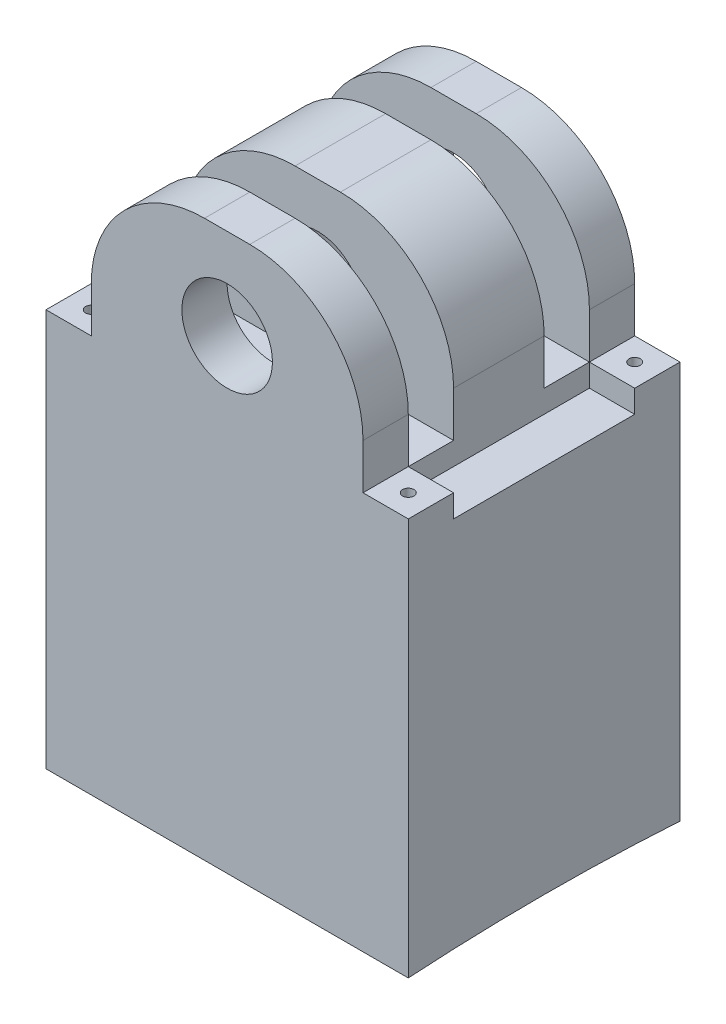
ISO-10303-21;
HEADER;
FILE_DESCRIPTION(('STEP AP214'),'2;1');
FILE_NAME('part.step','',(''),(''),'','','');
FILE_SCHEMA(('AUTOMOTIVE_DESIGN { 1 0 10303 214 1 1 1 1 }'));
ENDSEC;
DATA;
#1=APPLICATION_CONTEXT('core data for automotive mechanical design processes');
#2=APPLICATION_PROTOCOL_DEFINITION('international standard','automotive_design',2000,#1);
#3=PRODUCT_CONTEXT('',#1,'mechanical');
#4=PRODUCT('Part','Part','',(#3));
#5=PRODUCT_RELATED_PRODUCT_CATEGORY('part','',(#4));
#6=PRODUCT_DEFINITION_FORMATION('','',#4);
#7=PRODUCT_DEFINITION_CONTEXT('part definition',#1,'design');
#8=PRODUCT_DEFINITION('design','',#6,#7);
#9=PRODUCT_DEFINITION_SHAPE('','',#8);
#10=(LENGTH_UNIT() NAMED_UNIT(*) SI_UNIT(.MILLI.,.METRE.));
#11=(NAMED_UNIT(*) PLANE_ANGLE_UNIT() SI_UNIT($,.RADIAN.));
#12=(NAMED_UNIT(*) SI_UNIT($,.STERADIAN.) SOLID_ANGLE_UNIT());
#13=UNCERTAINTY_MEASURE_WITH_UNIT(LENGTH_MEASURE(1.E-05),#10,'distance_accuracy_value','');
#14=(GEOMETRIC_REPRESENTATION_CONTEXT(3) GLOBAL_UNCERTAINTY_ASSIGNED_CONTEXT((#13)) GLOBAL_UNIT_ASSIGNED_CONTEXT((#10,
#11,#12)) REPRESENTATION_CONTEXT('',''));
#15=CARTESIAN_POINT('',(0.,0.,0.));
#16=DIRECTION('',(0.,0.,1.));
#17=DIRECTION('',(1.,0.,0.));
#18=AXIS2_PLACEMENT_3D('',#15,#16,#17);
#19=CARTESIAN_POINT('',(-101.6,-50.8,152.4));
#20=DIRECTION('',(1.,0.,0.));
#21=DIRECTION('',(0.,0.,-1.));
#22=AXIS2_PLACEMENT_3D('',#19,#20,#21);
#23=PLANE('',#22);
#24=CARTESIAN_POINT('',(-101.6,-1458.68769541547,76.2));
#25=DIRECTION('',(-1.,0.,0.));
#26=DIRECTION('',(0.,0.,1.));
#27=AXIS2_PLACEMENT_3D('',#24,#25,#26);
#28=CIRCLE('',#27,1200.);
#29=CARTESIAN_POINT('',(-101.6,-261.109489200941,152.4));
#30=VERTEX_POINT('',#29);
#31=CARTESIAN_POINT('',(-101.6,-261.109489200941,0.));
#32=VERTEX_POINT('',#31);
#33=EDGE_CURVE('E222',#30,#32,#28,.T.);
#34=ORIENTED_EDGE('',*,*,#33,.F.);
#35=DIRECTION('',(0.,-1.,0.));
#36=VECTOR('',#35,1.);
#37=CARTESIAN_POINT('',(-101.6,-50.8,152.4));
#38=LINE('',#37,#36);
#39=CARTESIAN_POINT('',(-101.6,-38.1,152.4));
#40=VERTEX_POINT('',#39);
#41=EDGE_CURVE('E426',#40,#30,#38,.T.);
#42=ORIENTED_EDGE('',*,*,#41,.F.);
#43=DIRECTION('',(0.,0.,-1.));
#44=VECTOR('',#43,1.);
#45=CARTESIAN_POINT('',(-101.6,-38.1,152.4));
#46=LINE('',#45,#44);
#47=CARTESIAN_POINT('',(-101.6,-38.1,127.));
#48=VERTEX_POINT('',#47);
#49=EDGE_CURVE('E465',#40,#48,#46,.T.);
#50=ORIENTED_EDGE('',*,*,#49,.T.);
#51=DIRECTION('',(0.,1.,0.));
#52=VECTOR('',#51,1.);
#53=CARTESIAN_POINT('',(-101.6,-50.8000000000002,127.));
#54=LINE('',#53,#52);
#55=CARTESIAN_POINT('',(-101.6,-50.8000000000002,127.));
#56=VERTEX_POINT('',#55);
#57=EDGE_CURVE('E60',#56,#48,#54,.T.);
#58=ORIENTED_EDGE('',*,*,#57,.F.);
#59=DIRECTION('',(0.,0.,-1.));
#60=VECTOR('',#59,1.);
#61=CARTESIAN_POINT('',(-101.6,-50.8,444.838576880617));
#62=LINE('',#61,#60);
#63=CARTESIAN_POINT('',(-101.6,-50.8000000000002,25.4));
#64=VERTEX_POINT('',#63);
#65=EDGE_CURVE('E253',#56,#64,#62,.T.);
#66=ORIENTED_EDGE('',*,*,#65,.T.);
#67=DIRECTION('',(0.,1.,0.));
#68=VECTOR('',#67,1.);
#69=CARTESIAN_POINT('',(-101.6,-50.8000000000002,25.4));
#70=LINE('',#69,#68);
#71=CARTESIAN_POINT('',(-101.6,-38.1,25.4));
#72=VERTEX_POINT('',#71);
#73=EDGE_CURVE('E279',#64,#72,#70,.T.);
#74=ORIENTED_EDGE('',*,*,#73,.T.);
#75=CARTESIAN_POINT('',(-101.6,-38.1,0.));
#76=VERTEX_POINT('',#75);
#77=EDGE_CURVE('E239',#72,#76,#46,.T.);
#78=ORIENTED_EDGE('',*,*,#77,.T.);
#79=DIRECTION('',(0.,-1.,0.));
#80=VECTOR('',#79,1.);
#81=CARTESIAN_POINT('',(-101.6,-50.8,0.));
#82=LINE('',#81,#80);
#83=EDGE_CURVE('E236',#76,#32,#82,.T.);
#84=ORIENTED_EDGE('',*,*,#83,.T.);
#85=EDGE_LOOP('',(#34,#42,#50,#58,#66,#74,#78,#84));
#86=FACE_BOUND('',#85,.T.);
#87=ADVANCED_FACE('F37',(#86),#23,.F.);
#88=CARTESIAN_POINT('',(101.6,-50.8,152.4));
#89=DIRECTION('',(-1.,0.,0.));
#90=DIRECTION('',(0.,0.,1.));
#91=AXIS2_PLACEMENT_3D('',#88,#89,#90);
#92=PLANE('',#91);
#93=CARTESIAN_POINT('',(101.6,-1458.68769541547,76.2));
#94=DIRECTION('',(-1.,0.,0.));
#95=DIRECTION('',(0.,0.,1.));
#96=AXIS2_PLACEMENT_3D('',#93,#94,#95);
#97=CIRCLE('',#96,1200.);
#98=CARTESIAN_POINT('',(101.6,-261.109489200941,152.4));
#99=VERTEX_POINT('',#98);
#100=CARTESIAN_POINT('',(101.6,-261.109489200941,0.));
#101=VERTEX_POINT('',#100);
#102=EDGE_CURVE('E233',#99,#101,#97,.T.);
#103=ORIENTED_EDGE('',*,*,#102,.T.);
#104=DIRECTION('',(0.,1.,0.));
#105=VECTOR('',#104,1.);
#106=CARTESIAN_POINT('',(101.6,-50.8,0.));
#107=LINE('',#106,#105);
#108=CARTESIAN_POINT('',(101.6,-38.1,0.));
#109=VERTEX_POINT('',#108);
#110=EDGE_CURVE('E243',#101,#109,#107,.T.);
#111=ORIENTED_EDGE('',*,*,#110,.T.);
#112=DIRECTION('',(0.,0.,-1.));
#113=VECTOR('',#112,1.);
#114=CARTESIAN_POINT('',(101.6,-38.1,152.4));
#115=LINE('',#114,#113);
#116=CARTESIAN_POINT('',(101.6,-38.1,25.4000000000001));
#117=VERTEX_POINT('',#116);
#118=EDGE_CURVE('E461',#117,#109,#115,.T.);
#119=ORIENTED_EDGE('',*,*,#118,.F.);
#120=DIRECTION('',(0.,1.,0.));
#121=VECTOR('',#120,1.);
#122=CARTESIAN_POINT('',(101.6,-50.8000000000001,25.4));
#123=LINE('',#122,#121);
#124=CARTESIAN_POINT('',(101.6,-50.8000000000001,25.4));
#125=VERTEX_POINT('',#124);
#126=EDGE_CURVE('E52',#125,#117,#123,.T.);
#127=ORIENTED_EDGE('',*,*,#126,.F.);
#128=DIRECTION('',(0.,0.,-1.));
#129=VECTOR('',#128,1.);
#130=CARTESIAN_POINT('',(101.6,-50.8,444.838576880617));
#131=LINE('',#130,#129);
#132=CARTESIAN_POINT('',(101.6,-50.8000000000001,127.));
#133=VERTEX_POINT('',#132);
#134=EDGE_CURVE('E257',#133,#125,#131,.T.);
#135=ORIENTED_EDGE('',*,*,#134,.F.);
#136=DIRECTION('',(0.,1.,0.));
#137=VECTOR('',#136,1.);
#138=CARTESIAN_POINT('',(101.6,-50.8000000000001,127.));
#139=LINE('',#138,#137);
#140=CARTESIAN_POINT('',(101.6,-38.0999999999999,127.));
#141=VERTEX_POINT('',#140);
#142=EDGE_CURVE('E260',#133,#141,#139,.T.);
#143=ORIENTED_EDGE('',*,*,#142,.T.);
#144=CARTESIAN_POINT('',(101.6,-38.1,152.4));
#145=VERTEX_POINT('',#144);
#146=EDGE_CURVE('E462',#145,#141,#115,.T.);
#147=ORIENTED_EDGE('',*,*,#146,.F.);
#148=DIRECTION('',(0.,1.,0.));
#149=VECTOR('',#148,1.);
#150=CARTESIAN_POINT('',(101.6,-50.8,152.4));
#151=LINE('',#150,#149);
#152=EDGE_CURVE('E428',#99,#145,#151,.T.);
#153=ORIENTED_EDGE('',*,*,#152,.F.);
#154=EDGE_LOOP('',(#103,#111,#119,#127,#135,#143,#147,#153));
#155=FACE_BOUND('',#154,.T.);
#156=ADVANCED_FACE('F562',(#155),#92,.F.);
#157=CARTESIAN_POINT('',(76.2,-38.1,152.4));
#158=DIRECTION('',(0.,-1.,0.));
#159=DIRECTION('',(1.,0.,0.));
#160=AXIS2_PLACEMENT_3D('',#157,#158,#159);
#161=PLANE('',#160);
#162=CARTESIAN_POINT('',(-88.9,-38.1,12.7));
#163=DIRECTION('',(0.,1.,0.));
#164=DIRECTION('',(0.,0.,1.));
#165=AXIS2_PLACEMENT_3D('',#162,#163,#164);
#166=CIRCLE('',#165,3.175);
#167=CARTESIAN_POINT('',(-88.9,-38.1,15.875));
#168=VERTEX_POINT('',#167);
#169=EDGE_CURVE('E281',#168,#168,#166,.T.);
#170=ORIENTED_EDGE('',*,*,#169,.F.);
#171=EDGE_LOOP('',(#170));
#172=FACE_BOUND('',#171,.T.);
#173=ORIENTED_EDGE('',*,*,#77,.F.);
#174=DIRECTION('',(-1.,0.,0.));
#175=VECTOR('',#174,1.);
#176=CARTESIAN_POINT('',(-101.6,-38.1,25.4));
#177=LINE('',#176,#175);
#178=CARTESIAN_POINT('',(-76.2,-38.1,25.4));
#179=VERTEX_POINT('',#178);
#180=EDGE_CURVE('E267',#179,#72,#177,.T.);
#181=ORIENTED_EDGE('',*,*,#180,.F.);
#182=DIRECTION('',(0.,0.,-1.));
#183=VECTOR('',#182,1.);
#184=CARTESIAN_POINT('',(-76.2,-38.1,152.4));
#185=LINE('',#184,#183);
#186=CARTESIAN_POINT('',(-76.2,-38.1,0.));
#187=VERTEX_POINT('',#186);
#188=EDGE_CURVE('E468',#179,#187,#185,.T.);
#189=ORIENTED_EDGE('',*,*,#188,.T.);
#190=DIRECTION('',(-1.,0.,0.));
#191=VECTOR('',#190,1.);
#192=CARTESIAN_POINT('',(-76.2,-38.1,0.));
#193=LINE('',#192,#191);
#194=EDGE_CURVE('E244',#187,#76,#193,.T.);
#195=ORIENTED_EDGE('',*,*,#194,.T.);
#196=EDGE_LOOP('',(#173,#181,#189,#195));
#197=FACE_BOUND('',#196,.T.);
#198=ADVANCED_FACE('F547',(#172,#197),#161,.F.);
#199=DIRECTION('',(1.,0.,0.));
#200=VECTOR('',#199,1.);
#201=CARTESIAN_POINT('',(-101.6,-38.1,25.4));
#202=LINE('',#201,#200);
#203=CARTESIAN_POINT('',(76.2,-38.0999999999999,25.4));
#204=VERTEX_POINT('',#203);
#205=EDGE_CURVE('E349',#179,#204,#202,.T.);
#206=ORIENTED_EDGE('',*,*,#205,.F.);
#207=DIRECTION('',(0.,0.,1.));
#208=VECTOR('',#207,1.);
#209=CARTESIAN_POINT('',(-76.2,-38.0999999999999,152.4));
#210=LINE('',#209,#208);
#211=CARTESIAN_POINT('',(-76.2,-38.1,50.8));
#212=VERTEX_POINT('',#211);
#213=EDGE_CURVE('E11',#179,#212,#210,.T.);
#214=ORIENTED_EDGE('',*,*,#213,.T.);
#215=DIRECTION('',(1.,0.,0.));
#216=VECTOR('',#215,1.);
#217=CARTESIAN_POINT('',(-101.6,-38.1,50.8));
#218=LINE('',#217,#216);
#219=CARTESIAN_POINT('',(76.2,-38.0999999999999,50.8));
#220=VERTEX_POINT('',#219);
#221=EDGE_CURVE('E346',#212,#220,#218,.T.);
#222=ORIENTED_EDGE('',*,*,#221,.T.);
#223=DIRECTION('',(0.,0.,1.));
#224=VECTOR('',#223,1.);
#225=CARTESIAN_POINT('',(76.2,-38.0999999999999,25.4));
#226=LINE('',#225,#224);
#227=EDGE_CURVE('E299',#204,#220,#226,.T.);
#228=ORIENTED_EDGE('',*,*,#227,.F.);
#229=EDGE_LOOP('',(#206,#214,#222,#228));
#230=FACE_BOUND('',#229,.T.);
#231=ADVANCED_FACE('F555',(#230),#161,.F.);
#232=DIRECTION('',(1.,0.,0.));
#233=VECTOR('',#232,1.);
#234=CARTESIAN_POINT('',(-101.6,-38.1,101.6));
#235=LINE('',#234,#233);
#236=CARTESIAN_POINT('',(-76.2,-38.1,101.6));
#237=VERTEX_POINT('',#236);
#238=CARTESIAN_POINT('',(76.2,-38.0999999999999,101.6));
#239=VERTEX_POINT('',#238);
#240=EDGE_CURVE('E340',#237,#239,#235,.T.);
#241=ORIENTED_EDGE('',*,*,#240,.F.);
#242=DIRECTION('',(0.,0.,-1.));
#243=VECTOR('',#242,1.);
#244=CARTESIAN_POINT('',(-76.2,-38.1,25.4));
#245=LINE('',#244,#243);
#246=CARTESIAN_POINT('',(-76.2,-38.1,127.));
#247=VERTEX_POINT('',#246);
#248=EDGE_CURVE('E275',#247,#237,#245,.T.);
#249=ORIENTED_EDGE('',*,*,#248,.F.);
#250=DIRECTION('',(1.,0.,0.));
#251=VECTOR('',#250,1.);
#252=CARTESIAN_POINT('',(-101.6,-38.1,127.));
#253=LINE('',#252,#251);
#254=CARTESIAN_POINT('',(76.2,-38.0999999999999,127.));
#255=VERTEX_POINT('',#254);
#256=EDGE_CURVE('E343',#247,#255,#253,.T.);
#257=ORIENTED_EDGE('',*,*,#256,.T.);
#258=DIRECTION('',(0.,0.,-1.));
#259=VECTOR('',#258,1.);
#260=CARTESIAN_POINT('',(76.2,-38.1,152.4));
#261=LINE('',#260,#259);
#262=EDGE_CURVE('E45',#255,#239,#261,.T.);
#263=ORIENTED_EDGE('',*,*,#262,.T.);
#264=EDGE_LOOP('',(#241,#249,#257,#263));
#265=FACE_BOUND('',#264,.T.);
#266=ADVANCED_FACE('F496',(#265),#161,.F.);
#267=CARTESIAN_POINT('',(88.8999999999999,-38.0999999999999,139.7));
#268=DIRECTION('',(0.,1.,0.));
#269=DIRECTION('',(0.,0.,1.));
#270=AXIS2_PLACEMENT_3D('',#267,#268,#269);
#271=CIRCLE('',#270,3.175);
#272=CARTESIAN_POINT('',(88.8999999999999,-38.0999999999999,142.875));
#273=VERTEX_POINT('',#272);
#274=EDGE_CURVE('E327',#273,#273,#271,.T.);
#275=ORIENTED_EDGE('',*,*,#274,.F.);
#276=EDGE_LOOP('',(#275));
#277=FACE_BOUND('',#276,.T.);
#278=ORIENTED_EDGE('',*,*,#146,.T.);
#279=DIRECTION('',(1.,0.,0.));
#280=VECTOR('',#279,1.);
#281=CARTESIAN_POINT('',(101.6,-38.0999999999999,127.));
#282=LINE('',#281,#280);
#283=EDGE_CURVE('E297',#255,#141,#282,.T.);
#284=ORIENTED_EDGE('',*,*,#283,.F.);
#285=DIRECTION('',(0.,0.,-1.));
#286=VECTOR('',#285,1.);
#287=CARTESIAN_POINT('',(76.2,-38.1,152.4));
#288=LINE('',#287,#286);
#289=CARTESIAN_POINT('',(76.2,-38.1,152.4));
#290=VERTEX_POINT('',#289);
#291=EDGE_CURVE('E458',#290,#255,#288,.T.);
#292=ORIENTED_EDGE('',*,*,#291,.F.);
#293=DIRECTION('',(-1.,0.,0.));
#294=VECTOR('',#293,1.);
#295=CARTESIAN_POINT('',(76.2,-38.1,152.4));
#296=LINE('',#295,#294);
#297=EDGE_CURVE('E430',#145,#290,#296,.T.);
#298=ORIENTED_EDGE('',*,*,#297,.F.);
#299=EDGE_LOOP('',(#278,#284,#292,#298));
#300=FACE_BOUND('',#299,.T.);
#301=ADVANCED_FACE('F603',(#277,#300),#161,.F.);
#302=CARTESIAN_POINT('',(-76.2,-38.1,152.4));
#303=VERTEX_POINT('',#302);
#304=EDGE_CURVE('E469',#303,#247,#185,.T.);
#305=ORIENTED_EDGE('',*,*,#304,.T.);
#306=DIRECTION('',(1.,0.,0.));
#307=VECTOR('',#306,1.);
#308=CARTESIAN_POINT('',(-101.6,-38.1,127.));
#309=LINE('',#308,#307);
#310=EDGE_CURVE('E273',#48,#247,#309,.T.);
#311=ORIENTED_EDGE('',*,*,#310,.F.);
#312=ORIENTED_EDGE('',*,*,#49,.F.);
#313=DIRECTION('',(-1.,0.,0.));
#314=VECTOR('',#313,1.);
#315=CARTESIAN_POINT('',(-76.2,-38.1,152.4));
#316=LINE('',#315,#314);
#317=EDGE_CURVE('E424',#303,#40,#316,.T.);
#318=ORIENTED_EDGE('',*,*,#317,.F.);
#319=EDGE_LOOP('',(#305,#311,#312,#318));
#320=FACE_BOUND('',#319,.T.);
#321=CARTESIAN_POINT('',(-88.9,-38.1,139.7));
#322=DIRECTION('',(0.,1.,0.));
#323=DIRECTION('',(0.,0.,1.));
#324=AXIS2_PLACEMENT_3D('',#321,#322,#323);
#325=CIRCLE('',#324,3.175);
#326=CARTESIAN_POINT('',(-88.9,-38.1,142.875));
#327=VERTEX_POINT('',#326);
#328=EDGE_CURVE('E315',#327,#327,#325,.T.);
#329=ORIENTED_EDGE('',*,*,#328,.F.);
#330=EDGE_LOOP('',(#329));
#331=FACE_BOUND('',#330,.T.);
#332=ADVANCED_FACE('F574',(#320,#331),#161,.F.);
#333=CARTESIAN_POINT('',(12.7,-12.7,152.4));
#334=DIRECTION('',(0.,0.,-1.));
#335=DIRECTION('',(-1.,0.,0.));
#336=AXIS2_PLACEMENT_3D('',#333,#334,#335);
#337=CYLINDRICAL_SURFACE('',#336,63.5);
#338=DIRECTION('',(0.,0.,-1.));
#339=VECTOR('',#338,1.);
#340=CARTESIAN_POINT('',(76.2,-12.7000000000005,152.4));
#341=LINE('',#340,#339);
#342=CARTESIAN_POINT('',(76.2,-12.7000000000005,152.4));
#343=VERTEX_POINT('',#342);
#344=CARTESIAN_POINT('',(76.2,-12.7000000000005,127.));
#345=VERTEX_POINT('',#344);
#346=EDGE_CURVE('E453',#343,#345,#341,.T.);
#347=ORIENTED_EDGE('',*,*,#346,.T.);
#348=CARTESIAN_POINT('',(12.7,-12.7,127.));
#349=DIRECTION('',(0.,0.,1.));
#350=DIRECTION('',(1.,0.,0.));
#351=AXIS2_PLACEMENT_3D('',#348,#349,#350);
#352=CIRCLE('',#351,63.5);
#353=CARTESIAN_POINT('',(12.6999999999996,50.8,127.));
#354=VERTEX_POINT('',#353);
#355=EDGE_CURVE('E398',#345,#354,#352,.T.);
#356=ORIENTED_EDGE('',*,*,#355,.T.);
#357=DIRECTION('',(0.,0.,-1.));
#358=VECTOR('',#357,1.);
#359=CARTESIAN_POINT('',(12.6999999999996,50.8,152.4));
#360=LINE('',#359,#358);
#361=CARTESIAN_POINT('',(12.6999999999996,50.8,152.4));
#362=VERTEX_POINT('',#361);
#363=EDGE_CURVE('E483',#362,#354,#360,.T.);
#364=ORIENTED_EDGE('',*,*,#363,.F.);
#365=CARTESIAN_POINT('',(12.7,-12.7,152.4));
#366=DIRECTION('',(0.,0.,1.));
#367=DIRECTION('',(1.,0.,0.));
#368=AXIS2_PLACEMENT_3D('',#365,#366,#367);
#369=CIRCLE('',#368,63.5);
#370=EDGE_CURVE('E414',#343,#362,#369,.T.);
#371=ORIENTED_EDGE('',*,*,#370,.F.);
#372=EDGE_LOOP('',(#347,#356,#364,#371));
#373=FACE_BOUND('',#372,.T.);
#374=ADVANCED_FACE('F595',(#373),#337,.T.);
#375=CARTESIAN_POINT('',(12.6999999999996,50.8,101.6));
#376=VERTEX_POINT('',#375);
#377=CARTESIAN_POINT('',(12.6999999999996,50.8,50.8));
#378=VERTEX_POINT('',#377);
#379=EDGE_CURVE('E486',#376,#378,#360,.T.);
#380=ORIENTED_EDGE('',*,*,#379,.F.);
#381=CARTESIAN_POINT('',(12.7,-12.7,101.6));
#382=DIRECTION('',(0.,0.,-1.));
#383=DIRECTION('',(-1.,0.,0.));
#384=AXIS2_PLACEMENT_3D('',#381,#382,#383);
#385=CIRCLE('',#384,63.5);
#386=CARTESIAN_POINT('',(76.2,-12.7000000000005,101.6));
#387=VERTEX_POINT('',#386);
#388=EDGE_CURVE('E385',#376,#387,#385,.T.);
#389=ORIENTED_EDGE('',*,*,#388,.T.);
#390=CARTESIAN_POINT('',(76.2,-12.7000000000005,50.8));
#391=VERTEX_POINT('',#390);
#392=EDGE_CURVE('E457',#387,#391,#341,.T.);
#393=ORIENTED_EDGE('',*,*,#392,.T.);
#394=CARTESIAN_POINT('',(12.7,-12.7,50.8));
#395=DIRECTION('',(0.,0.,1.));
#396=DIRECTION('',(1.,0.,0.));
#397=AXIS2_PLACEMENT_3D('',#394,#395,#396);
#398=CIRCLE('',#397,63.5);
#399=EDGE_CURVE('E372',#391,#378,#398,.T.);
#400=ORIENTED_EDGE('',*,*,#399,.T.);
#401=EDGE_LOOP('',(#380,#389,#393,#400));
#402=FACE_BOUND('',#401,.T.);
#403=ADVANCED_FACE('F529',(#402),#337,.T.);
#404=CARTESIAN_POINT('',(-12.6999999999995,50.8,152.4));
#405=DIRECTION('',(0.,-1.,0.));
#406=DIRECTION('',(0.,0.,-1.));
#407=AXIS2_PLACEMENT_3D('',#404,#405,#406);
#408=PLANE('',#407);
#409=ORIENTED_EDGE('',*,*,#363,.T.);
#410=DIRECTION('',(1.,0.,0.));
#411=VECTOR('',#410,1.);
#412=CARTESIAN_POINT('',(-101.6,50.8,127.));
#413=LINE('',#412,#411);
#414=CARTESIAN_POINT('',(-12.7,50.8,127.));
#415=VERTEX_POINT('',#414);
#416=EDGE_CURVE('E334',#415,#354,#413,.T.);
#417=ORIENTED_EDGE('',*,*,#416,.F.);
#418=DIRECTION('',(0.,0.,-1.));
#419=VECTOR('',#418,1.);
#420=CARTESIAN_POINT('',(-12.6999999999995,50.8,152.4));
#421=LINE('',#420,#419);
#422=CARTESIAN_POINT('',(-12.6999999999995,50.8,152.4));
#423=VERTEX_POINT('',#422);
#424=EDGE_CURVE('E478',#423,#415,#421,.T.);
#425=ORIENTED_EDGE('',*,*,#424,.F.);
#426=DIRECTION('',(-1.,0.,0.));
#427=VECTOR('',#426,1.);
#428=CARTESIAN_POINT('',(-12.6999999999995,50.8,152.4));
#429=LINE('',#428,#427);
#430=EDGE_CURVE('E417',#362,#423,#429,.T.);
#431=ORIENTED_EDGE('',*,*,#430,.F.);
#432=EDGE_LOOP('',(#409,#417,#425,#431));
#433=FACE_BOUND('',#432,.T.);
#434=ADVANCED_FACE('F591',(#433),#408,.F.);
#435=CARTESIAN_POINT('',(-12.7,50.8,101.6));
#436=VERTEX_POINT('',#435);
#437=CARTESIAN_POINT('',(-12.7,50.8,50.8));
#438=VERTEX_POINT('',#437);
#439=EDGE_CURVE('E482',#436,#438,#421,.T.);
#440=ORIENTED_EDGE('',*,*,#439,.F.);
#441=DIRECTION('',(1.,0.,0.));
#442=VECTOR('',#441,1.);
#443=CARTESIAN_POINT('',(-101.6,50.8,101.6));
#444=LINE('',#443,#442);
#445=EDGE_CURVE('E337',#436,#376,#444,.T.);
#446=ORIENTED_EDGE('',*,*,#445,.T.);
#447=ORIENTED_EDGE('',*,*,#379,.T.);
#448=DIRECTION('',(1.,0.,0.));
#449=VECTOR('',#448,1.);
#450=CARTESIAN_POINT('',(-101.6,50.8,50.8));
#451=LINE('',#450,#449);
#452=EDGE_CURVE('E333',#438,#378,#451,.T.);
#453=ORIENTED_EDGE('',*,*,#452,.F.);
#454=EDGE_LOOP('',(#440,#446,#447,#453));
#455=FACE_BOUND('',#454,.T.);
#456=ADVANCED_FACE('F527',(#455),#408,.F.);
#457=CARTESIAN_POINT('',(-12.7,-12.7,152.4));
#458=DIRECTION('',(0.,0.,-1.));
#459=DIRECTION('',(-1.,0.,0.));
#460=AXIS2_PLACEMENT_3D('',#457,#458,#459);
#461=CYLINDRICAL_SURFACE('',#460,63.5);
#462=ORIENTED_EDGE('',*,*,#424,.T.);
#463=CARTESIAN_POINT('',(-12.7,-12.7,127.));
#464=DIRECTION('',(0.,0.,1.));
#465=DIRECTION('',(1.,0.,0.));
#466=AXIS2_PLACEMENT_3D('',#463,#464,#465);
#467=CIRCLE('',#466,63.5);
#468=CARTESIAN_POINT('',(-76.2,-12.7000000000005,127.));
#469=VERTEX_POINT('',#468);
#470=EDGE_CURVE('E404',#415,#469,#467,.T.);
#471=ORIENTED_EDGE('',*,*,#470,.T.);
#472=DIRECTION('',(0.,0.,-1.));
#473=VECTOR('',#472,1.);
#474=CARTESIAN_POINT('',(-76.2,-12.7000000000005,152.4));
#475=LINE('',#474,#473);
#476=CARTESIAN_POINT('',(-76.2,-12.7000000000005,152.4));
#477=VERTEX_POINT('',#476);
#478=EDGE_CURVE('E473',#477,#469,#475,.T.);
#479=ORIENTED_EDGE('',*,*,#478,.F.);
#480=CARTESIAN_POINT('',(-12.7,-12.7,152.4));
#481=DIRECTION('',(0.,0.,1.));
#482=DIRECTION('',(1.,0.,0.));
#483=AXIS2_PLACEMENT_3D('',#480,#481,#482);
#484=CIRCLE('',#483,63.5);
#485=EDGE_CURVE('E420',#423,#477,#484,.T.);
#486=ORIENTED_EDGE('',*,*,#485,.F.);
#487=EDGE_LOOP('',(#462,#471,#479,#486));
#488=FACE_BOUND('',#487,.T.);
#489=ADVANCED_FACE('F587',(#488),#461,.T.);
#490=CARTESIAN_POINT('',(-76.2,-12.7000000000005,101.6));
#491=VERTEX_POINT('',#490);
#492=CARTESIAN_POINT('',(-76.2,-12.7000000000005,50.8));
#493=VERTEX_POINT('',#492);
#494=EDGE_CURVE('E477',#491,#493,#475,.T.);
#495=ORIENTED_EDGE('',*,*,#494,.F.);
#496=CARTESIAN_POINT('',(-12.7,-12.7,101.6));
#497=DIRECTION('',(0.,0.,-1.));
#498=DIRECTION('',(-1.,0.,0.));
#499=AXIS2_PLACEMENT_3D('',#496,#497,#498);
#500=CIRCLE('',#499,63.5);
#501=EDGE_CURVE('E391',#491,#436,#500,.T.);
#502=ORIENTED_EDGE('',*,*,#501,.T.);
#503=ORIENTED_EDGE('',*,*,#439,.T.);
#504=CARTESIAN_POINT('',(-12.7,-12.7,50.8));
#505=DIRECTION('',(0.,0.,1.));
#506=DIRECTION('',(1.,0.,0.));
#507=AXIS2_PLACEMENT_3D('',#504,#505,#506);
#508=CIRCLE('',#507,63.5);
#509=EDGE_CURVE('E378',#438,#493,#508,.T.);
#510=ORIENTED_EDGE('',*,*,#509,.T.);
#511=EDGE_LOOP('',(#495,#502,#503,#510));
#512=FACE_BOUND('',#511,.T.);
#513=ADVANCED_FACE('F536',(#512),#461,.T.);
#514=CARTESIAN_POINT('',(-76.2,-38.1,152.4));
#515=DIRECTION('',(1.,0.,0.));
#516=DIRECTION('',(0.,1.,0.));
#517=AXIS2_PLACEMENT_3D('',#514,#515,#516);
#518=PLANE('',#517);
#519=ORIENTED_EDGE('',*,*,#478,.T.);
#520=DIRECTION('',(0.,-1.,0.));
#521=VECTOR('',#520,1.);
#522=CARTESIAN_POINT('',(-76.2,-38.1,127.));
#523=LINE('',#522,#521);
#524=EDGE_CURVE('E401',#469,#247,#523,.T.);
#525=ORIENTED_EDGE('',*,*,#524,.T.);
#526=ORIENTED_EDGE('',*,*,#304,.F.);
#527=DIRECTION('',(0.,-1.,0.));
#528=VECTOR('',#527,1.);
#529=CARTESIAN_POINT('',(-76.2,-38.1,152.4));
#530=LINE('',#529,#528);
#531=EDGE_CURVE('E422',#477,#303,#530,.T.);
#532=ORIENTED_EDGE('',*,*,#531,.F.);
#533=EDGE_LOOP('',(#519,#525,#526,#532));
#534=FACE_BOUND('',#533,.T.);
#535=ADVANCED_FACE('F582',(#534),#518,.F.);
#536=DIRECTION('',(0.,-1.,0.));
#537=VECTOR('',#536,1.);
#538=CARTESIAN_POINT('',(-76.2,-38.1,50.8));
#539=LINE('',#538,#537);
#540=EDGE_CURVE('E375',#493,#212,#539,.T.);
#541=ORIENTED_EDGE('',*,*,#540,.T.);
#542=ORIENTED_EDGE('',*,*,#213,.F.);
#543=DIRECTION('',(0.,1.,0.));
#544=VECTOR('',#543,1.);
#545=CARTESIAN_POINT('',(-76.2,-50.8000000000002,25.4));
#546=LINE('',#545,#544);
#547=CARTESIAN_POINT('',(-76.2,-50.8000000000002,25.4));
#548=VERTEX_POINT('',#547);
#549=EDGE_CURVE('E282',#548,#179,#546,.T.);
#550=ORIENTED_EDGE('',*,*,#549,.F.);
#551=DIRECTION('',(0.,0.,-1.));
#552=VECTOR('',#551,1.);
#553=CARTESIAN_POINT('',(-76.2,-50.8000000000002,25.4));
#554=LINE('',#553,#552);
#555=CARTESIAN_POINT('',(-76.2,-50.8000000000002,127.));
#556=VERTEX_POINT('',#555);
#557=EDGE_CURVE('E266',#556,#548,#554,.T.);
#558=ORIENTED_EDGE('',*,*,#557,.F.);
#559=DIRECTION('',(0.,1.,0.));
#560=VECTOR('',#559,1.);
#561=CARTESIAN_POINT('',(-76.2,-50.8000000000002,127.));
#562=LINE('',#561,#560);
#563=EDGE_CURVE('E285',#556,#247,#562,.T.);
#564=ORIENTED_EDGE('',*,*,#563,.T.);
#565=ORIENTED_EDGE('',*,*,#248,.T.);
#566=DIRECTION('',(0.,1.,0.));
#567=VECTOR('',#566,1.);
#568=CARTESIAN_POINT('',(-76.2,-38.1,101.6));
#569=LINE('',#568,#567);
#570=EDGE_CURVE('E388',#237,#491,#569,.T.);
#571=ORIENTED_EDGE('',*,*,#570,.T.);
#572=ORIENTED_EDGE('',*,*,#494,.T.);
#573=EDGE_LOOP('',(#541,#542,#550,#558,#564,#565,#571,#572));
#574=FACE_BOUND('',#573,.T.);
#575=ADVANCED_FACE('F538',(#574),#518,.F.);
#576=CARTESIAN_POINT('',(76.2,-38.1,152.4));
#577=DIRECTION('',(-1.,0.,0.));
#578=DIRECTION('',(0.,-1.,0.));
#579=AXIS2_PLACEMENT_3D('',#576,#577,#578);
#580=PLANE('',#579);
#581=ORIENTED_EDGE('',*,*,#291,.T.);
#582=DIRECTION('',(0.,1.,0.));
#583=VECTOR('',#582,1.);
#584=CARTESIAN_POINT('',(76.2,-38.1,127.));
#585=LINE('',#584,#583);
#586=EDGE_CURVE('E395',#255,#345,#585,.T.);
#587=ORIENTED_EDGE('',*,*,#586,.T.);
#588=ORIENTED_EDGE('',*,*,#346,.F.);
#589=DIRECTION('',(0.,1.,0.));
#590=VECTOR('',#589,1.);
#591=CARTESIAN_POINT('',(76.2,-38.1,152.4));
#592=LINE('',#591,#590);
#593=EDGE_CURVE('E432',#290,#343,#592,.T.);
#594=ORIENTED_EDGE('',*,*,#593,.F.);
#595=EDGE_LOOP('',(#581,#587,#588,#594));
#596=FACE_BOUND('',#595,.T.);
#597=ADVANCED_FACE('F598',(#596),#580,.F.);
#598=ORIENTED_EDGE('',*,*,#392,.F.);
#599=DIRECTION('',(0.,-1.,0.));
#600=VECTOR('',#599,1.);
#601=CARTESIAN_POINT('',(76.2,-38.1,101.6));
#602=LINE('',#601,#600);
#603=EDGE_CURVE('E382',#387,#239,#602,.T.);
#604=ORIENTED_EDGE('',*,*,#603,.T.);
#605=ORIENTED_EDGE('',*,*,#262,.F.);
#606=DIRECTION('',(0.,1.,0.));
#607=VECTOR('',#606,1.);
#608=CARTESIAN_POINT('',(76.2,-50.8000000000001,127.));
#609=LINE('',#608,#607);
#610=CARTESIAN_POINT('',(76.2,-50.8000000000001,127.));
#611=VERTEX_POINT('',#610);
#612=EDGE_CURVE('E292',#611,#255,#609,.T.);
#613=ORIENTED_EDGE('',*,*,#612,.F.);
#614=DIRECTION('',(0.,0.,1.));
#615=VECTOR('',#614,1.);
#616=CARTESIAN_POINT('',(76.2,-50.8000000000001,25.4));
#617=LINE('',#616,#615);
#618=CARTESIAN_POINT('',(76.2,-50.8000000000001,25.4));
#619=VERTEX_POINT('',#618);
#620=EDGE_CURVE('E305',#619,#611,#617,.T.);
#621=ORIENTED_EDGE('',*,*,#620,.F.);
#622=DIRECTION('',(0.,1.,0.));
#623=VECTOR('',#622,1.);
#624=CARTESIAN_POINT('',(76.2,-50.8000000000001,25.4));
#625=LINE('',#624,#623);
#626=EDGE_CURVE('E290',#619,#204,#625,.T.);
#627=ORIENTED_EDGE('',*,*,#626,.T.);
#628=ORIENTED_EDGE('',*,*,#227,.T.);
#629=DIRECTION('',(0.,1.,0.));
#630=VECTOR('',#629,1.);
#631=CARTESIAN_POINT('',(76.2,-38.1,50.8));
#632=LINE('',#631,#630);
#633=EDGE_CURVE('E369',#220,#391,#632,.T.);
#634=ORIENTED_EDGE('',*,*,#633,.T.);
#635=EDGE_LOOP('',(#598,#604,#605,#613,#621,#627,#628,#634));
#636=FACE_BOUND('',#635,.T.);
#637=ADVANCED_FACE('F505',(#636),#580,.F.);
#638=CARTESIAN_POINT('',(0.,0.,152.4));
#639=DIRECTION('',(0.,0.,-1.));
#640=DIRECTION('',(-1.,0.,0.));
#641=AXIS2_PLACEMENT_3D('',#638,#639,#640);
#642=CYLINDRICAL_SURFACE('',#641,25.4);
#643=CARTESIAN_POINT('',(0.,0.,127.));
#644=DIRECTION('',(0.,0.,1.));
#645=DIRECTION('',(1.,0.,0.));
#646=AXIS2_PLACEMENT_3D('',#643,#644,#645);
#647=CIRCLE('',#646,25.4);
#648=CARTESIAN_POINT('',(25.4,0.,127.));
#649=VERTEX_POINT('',#648);
#650=EDGE_CURVE('E394',#649,#649,#647,.T.);
#651=ORIENTED_EDGE('',*,*,#650,.F.);
#652=EDGE_LOOP('',(#651));
#653=FACE_BOUND('',#652,.T.);
#654=CARTESIAN_POINT('',(0.,0.,152.4));
#655=DIRECTION('',(0.,0.,1.));
#656=DIRECTION('',(1.,0.,0.));
#657=AXIS2_PLACEMENT_3D('',#654,#655,#656);
#658=CIRCLE('',#657,25.4);
#659=CARTESIAN_POINT('',(25.4,0.,152.4));
#660=VERTEX_POINT('',#659);
#661=EDGE_CURVE('E408',#660,#660,#658,.T.);
#662=ORIENTED_EDGE('',*,*,#661,.T.);
#663=EDGE_LOOP('',(#662));
#664=FACE_BOUND('',#663,.T.);
#665=ADVANCED_FACE('F662',(#653,#664),#642,.F.);
#666=CARTESIAN_POINT('',(12.7,-12.7,152.4));
#667=DIRECTION('',(0.,0.,1.));
#668=DIRECTION('',(1.,0.,0.));
#669=AXIS2_PLACEMENT_3D('',#666,#667,#668);
#670=PLANE('',#669);
#671=ORIENTED_EDGE('',*,*,#370,.T.);
#672=ORIENTED_EDGE('',*,*,#430,.T.);
#673=ORIENTED_EDGE('',*,*,#485,.T.);
#674=ORIENTED_EDGE('',*,*,#531,.T.);
#675=ORIENTED_EDGE('',*,*,#317,.T.);
#676=ORIENTED_EDGE('',*,*,#41,.T.);
#677=DIRECTION('',(-1.,0.,0.));
#678=VECTOR('',#677,1.);
#679=CARTESIAN_POINT('',(101.6,-261.109489200941,152.4));
#680=LINE('',#679,#678);
#681=EDGE_CURVE('E229',#99,#30,#680,.T.);
#682=ORIENTED_EDGE('',*,*,#681,.F.);
#683=ORIENTED_EDGE('',*,*,#152,.T.);
#684=ORIENTED_EDGE('',*,*,#297,.T.);
#685=ORIENTED_EDGE('',*,*,#593,.T.);
#686=EDGE_LOOP('',(#671,#672,#673,#674,#675,#676,#682,#683,#684,#685));
#687=FACE_BOUND('',#686,.T.);
#688=ORIENTED_EDGE('',*,*,#661,.F.);
#689=EDGE_LOOP('',(#688));
#690=FACE_BOUND('',#689,.T.);
#691=ADVANCED_FACE('F568',(#687,#690),#670,.T.);
#692=CARTESIAN_POINT('',(12.7,-12.7,0.));
#693=DIRECTION('',(0.,0.,1.));
#694=DIRECTION('',(1.,0.,0.));
#695=AXIS2_PLACEMENT_3D('',#692,#693,#694);
#696=PLANE('',#695);
#697=CARTESIAN_POINT('',(12.7,-12.7,0.));
#698=DIRECTION('',(0.,0.,1.));
#699=DIRECTION('',(1.,0.,0.));
#700=AXIS2_PLACEMENT_3D('',#697,#698,#699);
#701=CIRCLE('',#700,63.5);
#702=CARTESIAN_POINT('',(76.2,-12.7000000000005,0.));
#703=VERTEX_POINT('',#702);
#704=CARTESIAN_POINT('',(12.6999999999996,50.8,0.));
#705=VERTEX_POINT('',#704);
#706=EDGE_CURVE('E411',#703,#705,#701,.T.);
#707=ORIENTED_EDGE('',*,*,#706,.F.);
#708=DIRECTION('',(0.,1.,0.));
#709=VECTOR('',#708,1.);
#710=CARTESIAN_POINT('',(76.2,-38.1,0.));
#711=LINE('',#710,#709);
#712=CARTESIAN_POINT('',(76.2,-38.1,0.));
#713=VERTEX_POINT('',#712);
#714=EDGE_CURVE('E418',#713,#703,#711,.T.);
#715=ORIENTED_EDGE('',*,*,#714,.F.);
#716=DIRECTION('',(-1.,0.,0.));
#717=VECTOR('',#716,1.);
#718=CARTESIAN_POINT('',(76.2,-38.1,0.));
#719=LINE('',#718,#717);
#720=EDGE_CURVE('E448',#109,#713,#719,.T.);
#721=ORIENTED_EDGE('',*,*,#720,.F.);
#722=ORIENTED_EDGE('',*,*,#110,.F.);
#723=DIRECTION('',(-1.,0.,0.));
#724=VECTOR('',#723,1.);
#725=CARTESIAN_POINT('',(101.6,-261.109489200941,0.));
#726=LINE('',#725,#724);
#727=EDGE_CURVE('E226',#101,#32,#726,.T.);
#728=ORIENTED_EDGE('',*,*,#727,.T.);
#729=ORIENTED_EDGE('',*,*,#83,.F.);
#730=ORIENTED_EDGE('',*,*,#194,.F.);
#731=DIRECTION('',(0.,-1.,0.));
#732=VECTOR('',#731,1.);
#733=CARTESIAN_POINT('',(-76.2,-38.1,0.));
#734=LINE('',#733,#732);
#735=CARTESIAN_POINT('',(-76.2,-12.7000000000005,0.));
#736=VERTEX_POINT('',#735);
#737=EDGE_CURVE('E443',#736,#187,#734,.T.);
#738=ORIENTED_EDGE('',*,*,#737,.F.);
#739=CARTESIAN_POINT('',(-12.7,-12.7,0.));
#740=DIRECTION('',(0.,0.,1.));
#741=DIRECTION('',(1.,0.,0.));
#742=AXIS2_PLACEMENT_3D('',#739,#740,#741);
#743=CIRCLE('',#742,63.5);
#744=CARTESIAN_POINT('',(-12.6999999999995,50.8,0.));
#745=VERTEX_POINT('',#744);
#746=EDGE_CURVE('E440',#745,#736,#743,.T.);
#747=ORIENTED_EDGE('',*,*,#746,.F.);
#748=DIRECTION('',(-1.,0.,0.));
#749=VECTOR('',#748,1.);
#750=CARTESIAN_POINT('',(-12.6999999999995,50.8,0.));
#751=LINE('',#750,#749);
#752=EDGE_CURVE('E437',#705,#745,#751,.T.);
#753=ORIENTED_EDGE('',*,*,#752,.F.);
#754=EDGE_LOOP('',(#707,#715,#721,#722,#728,#729,#730,#738,#747,#753));
#755=FACE_BOUND('',#754,.T.);
#756=CARTESIAN_POINT('',(0.,0.,0.));
#757=DIRECTION('',(0.,0.,1.));
#758=DIRECTION('',(1.,0.,0.));
#759=AXIS2_PLACEMENT_3D('',#756,#757,#758);
#760=CIRCLE('',#759,25.4);
#761=CARTESIAN_POINT('',(25.4,0.,0.));
#762=VERTEX_POINT('',#761);
#763=EDGE_CURVE('E407',#762,#762,#760,.T.);
#764=ORIENTED_EDGE('',*,*,#763,.T.);
#765=EDGE_LOOP('',(#764));
#766=FACE_BOUND('',#765,.T.);
#767=ADVANCED_FACE('F248',(#755,#766),#696,.F.);
#768=CARTESIAN_POINT('',(12.6999999999996,50.8,25.4));
#769=VERTEX_POINT('',#768);
#770=EDGE_CURVE('E481',#769,#705,#360,.T.);
#771=ORIENTED_EDGE('',*,*,#770,.F.);
#772=CARTESIAN_POINT('',(12.7,-12.7,25.4));
#773=DIRECTION('',(0.,0.,-1.));
#774=DIRECTION('',(-1.,0.,0.));
#775=AXIS2_PLACEMENT_3D('',#772,#773,#774);
#776=CIRCLE('',#775,63.5);
#777=CARTESIAN_POINT('',(76.2,-12.7000000000005,25.4));
#778=VERTEX_POINT('',#777);
#779=EDGE_CURVE('E359',#769,#778,#776,.T.);
#780=ORIENTED_EDGE('',*,*,#779,.T.);
#781=EDGE_CURVE('E434',#778,#703,#341,.T.);
#782=ORIENTED_EDGE('',*,*,#781,.T.);
#783=ORIENTED_EDGE('',*,*,#706,.T.);
#784=EDGE_LOOP('',(#771,#780,#782,#783));
#785=FACE_BOUND('',#784,.T.);
#786=ADVANCED_FACE('F39',(#785),#337,.T.);
#787=CARTESIAN_POINT('',(-12.7,50.8,25.4));
#788=VERTEX_POINT('',#787);
#789=EDGE_CURVE('E476',#788,#745,#421,.T.);
#790=ORIENTED_EDGE('',*,*,#789,.F.);
#791=DIRECTION('',(1.,0.,0.));
#792=VECTOR('',#791,1.);
#793=CARTESIAN_POINT('',(-101.6,50.8,25.4));
#794=LINE('',#793,#792);
#795=EDGE_CURVE('E352',#788,#769,#794,.T.);
#796=ORIENTED_EDGE('',*,*,#795,.T.);
#797=ORIENTED_EDGE('',*,*,#770,.T.);
#798=ORIENTED_EDGE('',*,*,#752,.T.);
#799=EDGE_LOOP('',(#790,#796,#797,#798));
#800=FACE_BOUND('',#799,.T.);
#801=ADVANCED_FACE('F521',(#800),#408,.F.);
#802=CARTESIAN_POINT('',(-76.2,-12.7000000000005,25.4));
#803=VERTEX_POINT('',#802);
#804=EDGE_CURVE('E472',#803,#736,#475,.T.);
#805=ORIENTED_EDGE('',*,*,#804,.F.);
#806=CARTESIAN_POINT('',(-12.7,-12.7,25.4));
#807=DIRECTION('',(0.,0.,-1.));
#808=DIRECTION('',(-1.,0.,0.));
#809=AXIS2_PLACEMENT_3D('',#806,#807,#808);
#810=CIRCLE('',#809,63.5);
#811=EDGE_CURVE('E365',#803,#788,#810,.T.);
#812=ORIENTED_EDGE('',*,*,#811,.T.);
#813=ORIENTED_EDGE('',*,*,#789,.T.);
#814=ORIENTED_EDGE('',*,*,#746,.T.);
#815=EDGE_LOOP('',(#805,#812,#813,#814));
#816=FACE_BOUND('',#815,.T.);
#817=ADVANCED_FACE('F545',(#816),#461,.T.);
#818=ORIENTED_EDGE('',*,*,#188,.F.);
#819=DIRECTION('',(0.,1.,0.));
#820=VECTOR('',#819,1.);
#821=CARTESIAN_POINT('',(-76.2,-38.1,25.4));
#822=LINE('',#821,#820);
#823=EDGE_CURVE('E362',#179,#803,#822,.T.);
#824=ORIENTED_EDGE('',*,*,#823,.T.);
#825=ORIENTED_EDGE('',*,*,#804,.T.);
#826=ORIENTED_EDGE('',*,*,#737,.T.);
#827=EDGE_LOOP('',(#818,#824,#825,#826));
#828=FACE_BOUND('',#827,.T.);
#829=ADVANCED_FACE('F542',(#828),#518,.F.);
#830=CARTESIAN_POINT('',(88.8999999999999,-38.0999999999999,12.7));
#831=DIRECTION('',(0.,1.,0.));
#832=DIRECTION('',(0.,0.,1.));
#833=AXIS2_PLACEMENT_3D('',#830,#831,#832);
#834=CIRCLE('',#833,3.175);
#835=CARTESIAN_POINT('',(88.8999999999999,-38.0999999999999,15.875));
#836=VERTEX_POINT('',#835);
#837=EDGE_CURVE('E321',#836,#836,#834,.T.);
#838=ORIENTED_EDGE('',*,*,#837,.F.);
#839=EDGE_LOOP('',(#838));
#840=FACE_BOUND('',#839,.T.);
#841=EDGE_CURVE('E456',#204,#713,#288,.T.);
#842=ORIENTED_EDGE('',*,*,#841,.F.);
#843=DIRECTION('',(-1.,0.,0.));
#844=VECTOR('',#843,1.);
#845=CARTESIAN_POINT('',(101.6,-38.0999999999999,25.4));
#846=LINE('',#845,#844);
#847=EDGE_CURVE('E276',#117,#204,#846,.T.);
#848=ORIENTED_EDGE('',*,*,#847,.F.);
#849=ORIENTED_EDGE('',*,*,#118,.T.);
#850=ORIENTED_EDGE('',*,*,#720,.T.);
#851=EDGE_LOOP('',(#842,#848,#849,#850));
#852=FACE_BOUND('',#851,.T.);
#853=ADVANCED_FACE('F560',(#840,#852),#161,.F.);
#854=ORIENTED_EDGE('',*,*,#781,.F.);
#855=DIRECTION('',(0.,-1.,0.));
#856=VECTOR('',#855,1.);
#857=CARTESIAN_POINT('',(76.2,-38.1,25.4));
#858=LINE('',#857,#856);
#859=EDGE_CURVE('E356',#778,#204,#858,.T.);
#860=ORIENTED_EDGE('',*,*,#859,.T.);
#861=ORIENTED_EDGE('',*,*,#841,.T.);
#862=ORIENTED_EDGE('',*,*,#714,.T.);
#863=EDGE_LOOP('',(#854,#860,#861,#862));
#864=FACE_BOUND('',#863,.T.);
#865=ADVANCED_FACE('F514',(#864),#580,.F.);
#866=CARTESIAN_POINT('',(0.,0.,25.4));
#867=DIRECTION('',(0.,0.,-1.));
#868=DIRECTION('',(-1.,0.,0.));
#869=AXIS2_PLACEMENT_3D('',#866,#867,#868);
#870=CIRCLE('',#869,25.4);
#871=CARTESIAN_POINT('',(-25.4,0.,25.4));
#872=VERTEX_POINT('',#871);
#873=EDGE_CURVE('E336',#872,#872,#870,.T.);
#874=ORIENTED_EDGE('',*,*,#873,.F.);
#875=EDGE_LOOP('',(#874));
#876=FACE_BOUND('',#875,.T.);
#877=ORIENTED_EDGE('',*,*,#763,.F.);
#878=EDGE_LOOP('',(#877));
#879=FACE_BOUND('',#878,.T.);
#880=ADVANCED_FACE('F665',(#876,#879),#642,.F.);
#881=CARTESIAN_POINT('',(-101.6,-38.1,50.8));
#882=DIRECTION('',(0.,0.,1.));
#883=DIRECTION('',(1.,0.,0.));
#884=AXIS2_PLACEMENT_3D('',#881,#882,#883);
#885=PLANE('',#884);
#886=CARTESIAN_POINT('',(0.,0.,50.8));
#887=DIRECTION('',(0.,0.,1.));
#888=DIRECTION('',(1.,0.,0.));
#889=AXIS2_PLACEMENT_3D('',#886,#887,#888);
#890=CIRCLE('',#889,25.4);
#891=CARTESIAN_POINT('',(25.4,0.,50.8));
#892=VERTEX_POINT('',#891);
#893=EDGE_CURVE('E368',#892,#892,#890,.T.);
#894=ORIENTED_EDGE('',*,*,#893,.T.);
#895=EDGE_LOOP('',(#894));
#896=FACE_BOUND('',#895,.T.);
#897=ORIENTED_EDGE('',*,*,#452,.T.);
#898=ORIENTED_EDGE('',*,*,#399,.F.);
#899=ORIENTED_EDGE('',*,*,#633,.F.);
#900=ORIENTED_EDGE('',*,*,#221,.F.);
#901=ORIENTED_EDGE('',*,*,#540,.F.);
#902=ORIENTED_EDGE('',*,*,#509,.F.);
#903=EDGE_LOOP('',(#897,#898,#899,#900,#901,#902));
#904=FACE_BOUND('',#903,.T.);
#905=ADVANCED_FACE('F531',(#896,#904),#885,.F.);
#906=CARTESIAN_POINT('',(-101.6,-38.1,25.4));
#907=DIRECTION('',(0.,0.,-1.));
#908=DIRECTION('',(-1.,0.,0.));
#909=AXIS2_PLACEMENT_3D('',#906,#907,#908);
#910=PLANE('',#909);
#911=ORIENTED_EDGE('',*,*,#873,.T.);
#912=EDGE_LOOP('',(#911));
#913=FACE_BOUND('',#912,.T.);
#914=ORIENTED_EDGE('',*,*,#823,.F.);
#915=ORIENTED_EDGE('',*,*,#205,.T.);
#916=ORIENTED_EDGE('',*,*,#859,.F.);
#917=ORIENTED_EDGE('',*,*,#779,.F.);
#918=ORIENTED_EDGE('',*,*,#795,.F.);
#919=ORIENTED_EDGE('',*,*,#811,.F.);
#920=EDGE_LOOP('',(#914,#915,#916,#917,#918,#919));
#921=FACE_BOUND('',#920,.T.);
#922=ADVANCED_FACE('F552',(#913,#921),#910,.F.);
#923=CARTESIAN_POINT('',(0.,0.,101.6));
#924=DIRECTION('',(0.,0.,-1.));
#925=DIRECTION('',(-1.,0.,0.));
#926=AXIS2_PLACEMENT_3D('',#923,#924,#925);
#927=CIRCLE('',#926,25.4);
#928=CARTESIAN_POINT('',(-25.4,0.,101.6));
#929=VERTEX_POINT('',#928);
#930=EDGE_CURVE('E381',#929,#929,#927,.T.);
#931=ORIENTED_EDGE('',*,*,#930,.F.);
#932=EDGE_LOOP('',(#931));
#933=FACE_BOUND('',#932,.T.);
#934=ORIENTED_EDGE('',*,*,#893,.F.);
#935=EDGE_LOOP('',(#934));
#936=FACE_BOUND('',#935,.T.);
#937=ADVANCED_FACE('F672',(#933,#936),#642,.F.);
#938=CARTESIAN_POINT('',(-101.6,-38.1,127.));
#939=DIRECTION('',(0.,0.,1.));
#940=DIRECTION('',(1.,0.,0.));
#941=AXIS2_PLACEMENT_3D('',#938,#939,#940);
#942=PLANE('',#941);
#943=ORIENTED_EDGE('',*,*,#650,.T.);
#944=EDGE_LOOP('',(#943));
#945=FACE_BOUND('',#944,.T.);
#946=ORIENTED_EDGE('',*,*,#416,.T.);
#947=ORIENTED_EDGE('',*,*,#355,.F.);
#948=ORIENTED_EDGE('',*,*,#586,.F.);
#949=ORIENTED_EDGE('',*,*,#256,.F.);
#950=ORIENTED_EDGE('',*,*,#524,.F.);
#951=ORIENTED_EDGE('',*,*,#470,.F.);
#952=EDGE_LOOP('',(#946,#947,#948,#949,#950,#951));
#953=FACE_BOUND('',#952,.T.);
#954=ADVANCED_FACE('F580',(#945,#953),#942,.F.);
#955=CARTESIAN_POINT('',(-101.6,-38.1,101.6));
#956=DIRECTION('',(0.,0.,-1.));
#957=DIRECTION('',(-1.,0.,0.));
#958=AXIS2_PLACEMENT_3D('',#955,#956,#957);
#959=PLANE('',#958);
#960=ORIENTED_EDGE('',*,*,#930,.T.);
#961=EDGE_LOOP('',(#960));
#962=FACE_BOUND('',#961,.T.);
#963=ORIENTED_EDGE('',*,*,#570,.F.);
#964=ORIENTED_EDGE('',*,*,#240,.T.);
#965=ORIENTED_EDGE('',*,*,#603,.F.);
#966=ORIENTED_EDGE('',*,*,#388,.F.);
#967=ORIENTED_EDGE('',*,*,#445,.F.);
#968=ORIENTED_EDGE('',*,*,#501,.F.);
#969=EDGE_LOOP('',(#963,#964,#965,#966,#967,#968));
#970=FACE_BOUND('',#969,.T.);
#971=ADVANCED_FACE('F503',(#962,#970),#959,.F.);
#972=CARTESIAN_POINT('',(88.8999999999999,-38.0999999999999,139.7));
#973=DIRECTION('',(0.,1.,0.));
#974=DIRECTION('',(0.,0.,1.));
#975=AXIS2_PLACEMENT_3D('',#972,#973,#974);
#976=CYLINDRICAL_SURFACE('',#975,3.175);
#977=CARTESIAN_POINT('',(88.8999999999999,-50.8,139.7));
#978=DIRECTION('',(0.,1.,0.));
#979=DIRECTION('',(0.,0.,1.));
#980=AXIS2_PLACEMENT_3D('',#977,#978,#979);
#981=CIRCLE('',#980,3.175);
#982=CARTESIAN_POINT('',(88.8999999999999,-50.8,142.875));
#983=VERTEX_POINT('',#982);
#984=EDGE_CURVE('E330',#983,#983,#981,.T.);
#985=ORIENTED_EDGE('',*,*,#984,.F.);
#986=EDGE_LOOP('',(#985));
#987=FACE_BOUND('',#986,.T.);
#988=ORIENTED_EDGE('',*,*,#274,.T.);
#989=EDGE_LOOP('',(#988));
#990=FACE_BOUND('',#989,.T.);
#991=ADVANCED_FACE('F690',(#987,#990),#976,.F.);
#992=CARTESIAN_POINT('',(88.8999999999999,-38.0999999999999,12.7));
#993=DIRECTION('',(0.,1.,0.));
#994=DIRECTION('',(0.,0.,1.));
#995=AXIS2_PLACEMENT_3D('',#992,#993,#994);
#996=CYLINDRICAL_SURFACE('',#995,3.175);
#997=CARTESIAN_POINT('',(88.8999999999999,-50.8,12.7));
#998=DIRECTION('',(0.,1.,0.));
#999=DIRECTION('',(0.,0.,1.));
#1000=AXIS2_PLACEMENT_3D('',#997,#998,#999);
#1001=CIRCLE('',#1000,3.175);
#1002=CARTESIAN_POINT('',(88.8999999999999,-50.8,15.875));
#1003=VERTEX_POINT('',#1002);
#1004=EDGE_CURVE('E324',#1003,#1003,#1001,.T.);
#1005=ORIENTED_EDGE('',*,*,#1004,.F.);
#1006=EDGE_LOOP('',(#1005));
#1007=FACE_BOUND('',#1006,.T.);
#1008=ORIENTED_EDGE('',*,*,#837,.T.);
#1009=EDGE_LOOP('',(#1008));
#1010=FACE_BOUND('',#1009,.T.);
#1011=ADVANCED_FACE('F692',(#1007,#1010),#996,.F.);
#1012=CARTESIAN_POINT('',(-88.9,-38.1,139.7));
#1013=DIRECTION('',(0.,1.,0.));
#1014=DIRECTION('',(0.,0.,1.));
#1015=AXIS2_PLACEMENT_3D('',#1012,#1013,#1014);
#1016=CYLINDRICAL_SURFACE('',#1015,3.175);
#1017=CARTESIAN_POINT('',(-88.9,-50.8000000000001,139.7));
#1018=DIRECTION('',(0.,1.,0.));
#1019=DIRECTION('',(0.,0.,1.));
#1020=AXIS2_PLACEMENT_3D('',#1017,#1018,#1019);
#1021=CIRCLE('',#1020,3.175);
#1022=CARTESIAN_POINT('',(-88.9,-50.8000000000001,142.875));
#1023=VERTEX_POINT('',#1022);
#1024=EDGE_CURVE('E318',#1023,#1023,#1021,.T.);
#1025=ORIENTED_EDGE('',*,*,#1024,.F.);
#1026=EDGE_LOOP('',(#1025));
#1027=FACE_BOUND('',#1026,.T.);
#1028=ORIENTED_EDGE('',*,*,#328,.T.);
#1029=EDGE_LOOP('',(#1028));
#1030=FACE_BOUND('',#1029,.T.);
#1031=ADVANCED_FACE('F699',(#1027,#1030),#1016,.F.);
#1032=CARTESIAN_POINT('',(-88.9,-38.1,12.7));
#1033=DIRECTION('',(0.,1.,0.));
#1034=DIRECTION('',(0.,0.,1.));
#1035=AXIS2_PLACEMENT_3D('',#1032,#1033,#1034);
#1036=CYLINDRICAL_SURFACE('',#1035,3.175);
#1037=CARTESIAN_POINT('',(-88.9,-50.8000000000001,12.7));
#1038=DIRECTION('',(0.,1.,0.));
#1039=DIRECTION('',(0.,0.,1.));
#1040=AXIS2_PLACEMENT_3D('',#1037,#1038,#1039);
#1041=CIRCLE('',#1040,3.175);
#1042=CARTESIAN_POINT('',(-88.9,-50.8000000000001,15.875));
#1043=VERTEX_POINT('',#1042);
#1044=EDGE_CURVE('E312',#1043,#1043,#1041,.T.);
#1045=ORIENTED_EDGE('',*,*,#1044,.F.);
#1046=EDGE_LOOP('',(#1045));
#1047=FACE_BOUND('',#1046,.T.);
#1048=ORIENTED_EDGE('',*,*,#169,.T.);
#1049=EDGE_LOOP('',(#1048));
#1050=FACE_BOUND('',#1049,.T.);
#1051=ADVANCED_FACE('F979',(#1047,#1050),#1036,.F.);
#1052=CARTESIAN_POINT('',(101.6,-50.8000000000001,127.));
#1053=DIRECTION('',(0.,0.,1.));
#1054=DIRECTION('',(1.,0.,0.));
#1055=AXIS2_PLACEMENT_3D('',#1052,#1053,#1054);
#1056=PLANE('',#1055);
#1057=ORIENTED_EDGE('',*,*,#283,.T.);
#1058=ORIENTED_EDGE('',*,*,#142,.F.);
#1059=DIRECTION('',(1.,0.,0.));
#1060=VECTOR('',#1059,1.);
#1061=CARTESIAN_POINT('',(101.6,-50.8000000000001,127.));
#1062=LINE('',#1061,#1060);
#1063=EDGE_CURVE('E289',#611,#133,#1062,.T.);
#1064=ORIENTED_EDGE('',*,*,#1063,.F.);
#1065=ORIENTED_EDGE('',*,*,#612,.T.);
#1066=EDGE_LOOP('',(#1057,#1058,#1064,#1065));
#1067=FACE_BOUND('',#1066,.T.);
#1068=ADVANCED_FACE('F605',(#1067),#1056,.F.);
#1069=CARTESIAN_POINT('',(101.6,-50.8000000000001,25.4));
#1070=DIRECTION('',(0.,0.,-1.));
#1071=DIRECTION('',(-1.,0.,0.));
#1072=AXIS2_PLACEMENT_3D('',#1069,#1070,#1071);
#1073=PLANE('',#1072);
#1074=ORIENTED_EDGE('',*,*,#847,.T.);
#1075=ORIENTED_EDGE('',*,*,#626,.F.);
#1076=DIRECTION('',(-1.,0.,0.));
#1077=VECTOR('',#1076,1.);
#1078=CARTESIAN_POINT('',(101.6,-50.8000000000001,25.4));
#1079=LINE('',#1078,#1077);
#1080=EDGE_CURVE('E300',#125,#619,#1079,.T.);
#1081=ORIENTED_EDGE('',*,*,#1080,.F.);
#1082=ORIENTED_EDGE('',*,*,#126,.T.);
#1083=EDGE_LOOP('',(#1074,#1075,#1081,#1082));
#1084=FACE_BOUND('',#1083,.T.);
#1085=ADVANCED_FACE('F557',(#1084),#1073,.F.);
#1086=CARTESIAN_POINT('',(-101.6,-50.8000000000002,25.4));
#1087=DIRECTION('',(0.,0.,-1.));
#1088=DIRECTION('',(-1.,0.,0.));
#1089=AXIS2_PLACEMENT_3D('',#1086,#1087,#1088);
#1090=PLANE('',#1089);
#1091=ORIENTED_EDGE('',*,*,#180,.T.);
#1092=ORIENTED_EDGE('',*,*,#73,.F.);
#1093=DIRECTION('',(-1.,0.,0.));
#1094=VECTOR('',#1093,1.);
#1095=CARTESIAN_POINT('',(-101.6,-50.8000000000002,25.4));
#1096=LINE('',#1095,#1094);
#1097=EDGE_CURVE('E270',#548,#64,#1096,.T.);
#1098=ORIENTED_EDGE('',*,*,#1097,.F.);
#1099=ORIENTED_EDGE('',*,*,#549,.T.);
#1100=EDGE_LOOP('',(#1091,#1092,#1098,#1099));
#1101=FACE_BOUND('',#1100,.T.);
#1102=ADVANCED_FACE('F1043',(#1101),#1090,.F.);
#1103=CARTESIAN_POINT('',(-101.6,-50.8000000000002,127.));
#1104=DIRECTION('',(0.,0.,1.));
#1105=DIRECTION('',(1.,0.,0.));
#1106=AXIS2_PLACEMENT_3D('',#1103,#1104,#1105);
#1107=PLANE('',#1106);
#1108=ORIENTED_EDGE('',*,*,#310,.T.);
#1109=ORIENTED_EDGE('',*,*,#563,.F.);
#1110=DIRECTION('',(1.,0.,0.));
#1111=VECTOR('',#1110,1.);
#1112=CARTESIAN_POINT('',(-101.6,-50.8000000000002,127.));
#1113=LINE('',#1112,#1111);
#1114=EDGE_CURVE('E263',#56,#556,#1113,.T.);
#1115=ORIENTED_EDGE('',*,*,#1114,.F.);
#1116=ORIENTED_EDGE('',*,*,#57,.T.);
#1117=EDGE_LOOP('',(#1108,#1109,#1115,#1116));
#1118=FACE_BOUND('',#1117,.T.);
#1119=ADVANCED_FACE('F578',(#1118),#1107,.F.);
#1120=CARTESIAN_POINT('',(101.6,-50.8,444.838576880617));
#1121=DIRECTION('',(0.,1.,0.));
#1122=DIRECTION('',(0.,0.,1.));
#1123=AXIS2_PLACEMENT_3D('',#1120,#1121,#1122);
#1124=PLANE('',#1123);
#1125=ORIENTED_EDGE('',*,*,#557,.T.);
#1126=ORIENTED_EDGE('',*,*,#1097,.T.);
#1127=ORIENTED_EDGE('',*,*,#65,.F.);
#1128=ORIENTED_EDGE('',*,*,#1114,.T.);
#1129=EDGE_LOOP('',(#1125,#1126,#1127,#1128));
#1130=FACE_BOUND('',#1129,.T.);
#1131=ADVANCED_FACE('F611',(#1130),#1124,.T.);
#1132=ORIENTED_EDGE('',*,*,#134,.T.);
#1133=ORIENTED_EDGE('',*,*,#1080,.T.);
#1134=ORIENTED_EDGE('',*,*,#620,.T.);
#1135=ORIENTED_EDGE('',*,*,#1063,.T.);
#1136=EDGE_LOOP('',(#1132,#1133,#1134,#1135));
#1137=FACE_BOUND('',#1136,.T.);
#1138=ADVANCED_FACE('F608',(#1137),#1124,.T.);
#1139=ORIENTED_EDGE('',*,*,#984,.T.);
#1140=EDGE_LOOP('',(#1139));
#1141=FACE_BOUND('',#1140,.T.);
#1142=ADVANCED_FACE('F610',(#1141),#1124,.T.);
#1143=ORIENTED_EDGE('',*,*,#1004,.T.);
#1144=EDGE_LOOP('',(#1143));
#1145=FACE_BOUND('',#1144,.T.);
#1146=ADVANCED_FACE('F617',(#1145),#1124,.T.);
#1147=ORIENTED_EDGE('',*,*,#1024,.T.);
#1148=EDGE_LOOP('',(#1147));
#1149=FACE_BOUND('',#1148,.T.);
#1150=ADVANCED_FACE('F752',(#1149),#1124,.T.);
#1151=ORIENTED_EDGE('',*,*,#1044,.T.);
#1152=EDGE_LOOP('',(#1151));
#1153=FACE_BOUND('',#1152,.T.);
#1154=ADVANCED_FACE('F620',(#1153),#1124,.T.);
#1155=CARTESIAN_POINT('',(-101.6,-1458.68769541547,76.2));
#1156=DIRECTION('',(1.,0.,0.));
#1157=DIRECTION('',(0.,0.,-1.));
#1158=AXIS2_PLACEMENT_3D('',#1155,#1156,#1157);
#1159=CYLINDRICAL_SURFACE('',#1158,1200.);
#1160=ORIENTED_EDGE('',*,*,#102,.F.);
#1161=ORIENTED_EDGE('',*,*,#681,.T.);
#1162=ORIENTED_EDGE('',*,*,#33,.T.);
#1163=ORIENTED_EDGE('',*,*,#727,.F.);
#1164=EDGE_LOOP('',(#1160,#1161,#1162,#1163));
#1165=FACE_BOUND('',#1164,.T.);
#1166=ADVANCED_FACE('F224',(#1165),#1159,.F.);
#1167=CLOSED_SHELL('',(#87,#156,#198,#231,#266,#301,#332,#374,#403,#434,#456,#489,#513,#535,
#575,#597,#637,#665,#691,#767,#786,#801,#817,#829,#853,#865,#880,#905,#922,#937,#954,#971,#991,
#1011,#1031,#1051,#1068,#1085,#1102,#1119,#1131,#1138,#1142,#1146,#1150,#1154,#1166));
#1168=MANIFOLD_SOLID_BREP('B2',#1167);
#1169=ADVANCED_BREP_SHAPE_REPRESENTATION('',(#18,#1168),#14);
#1170=SHAPE_DEFINITION_REPRESENTATION(#9,#1169);
ENDSEC;
END-ISO-10303-21;
